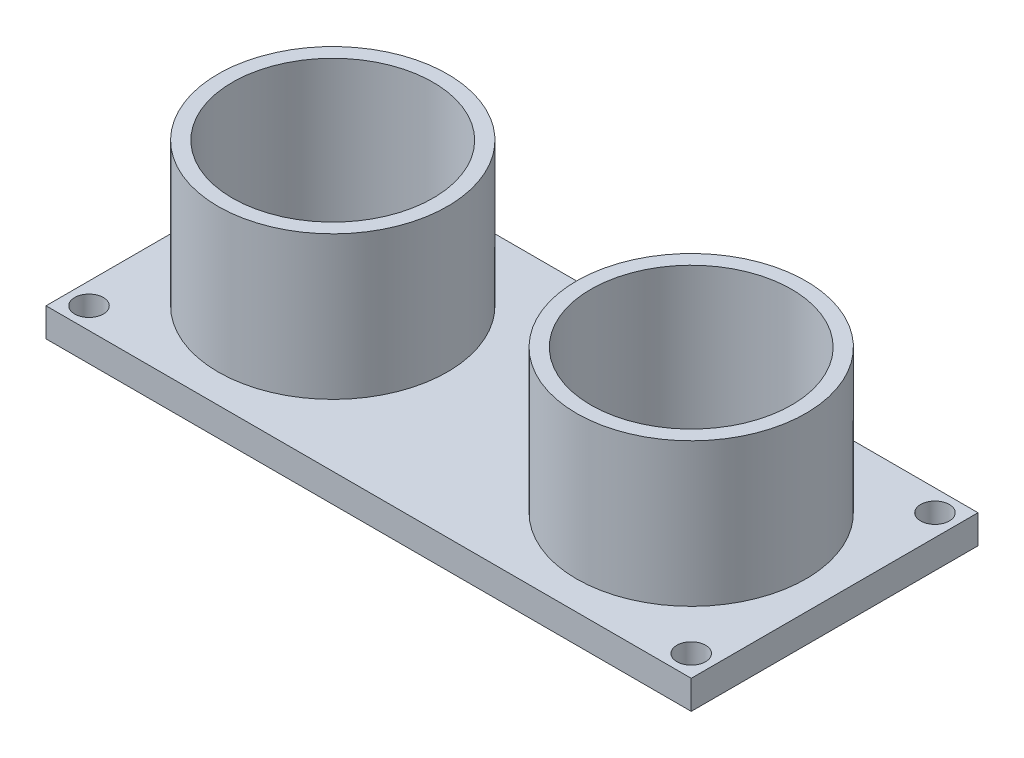
ISO-10303-21;
HEADER;
FILE_DESCRIPTION(('STEP AP214'),'2;1');
FILE_NAME('part.step','',(''),(''),'','','');
FILE_SCHEMA(('AUTOMOTIVE_DESIGN { 1 0 10303 214 1 1 1 1 }'));
ENDSEC;
DATA;
#1=APPLICATION_CONTEXT('core data for automotive mechanical design processes');
#2=APPLICATION_PROTOCOL_DEFINITION('international standard','automotive_design',2000,#1);
#3=PRODUCT_CONTEXT('',#1,'mechanical');
#4=PRODUCT('Part','Part','',(#3));
#5=PRODUCT_RELATED_PRODUCT_CATEGORY('part','',(#4));
#6=PRODUCT_DEFINITION_FORMATION('','',#4);
#7=PRODUCT_DEFINITION_CONTEXT('part definition',#1,'design');
#8=PRODUCT_DEFINITION('design','',#6,#7);
#9=PRODUCT_DEFINITION_SHAPE('','',#8);
#10=(LENGTH_UNIT() NAMED_UNIT(*) SI_UNIT(.MILLI.,.METRE.));
#11=(NAMED_UNIT(*) PLANE_ANGLE_UNIT() SI_UNIT($,.RADIAN.));
#12=(NAMED_UNIT(*) SI_UNIT($,.STERADIAN.) SOLID_ANGLE_UNIT());
#13=UNCERTAINTY_MEASURE_WITH_UNIT(LENGTH_MEASURE(1.E-05),#10,'distance_accuracy_value','');
#14=(GEOMETRIC_REPRESENTATION_CONTEXT(3) GLOBAL_UNCERTAINTY_ASSIGNED_CONTEXT((#13)) GLOBAL_UNIT_ASSIGNED_CONTEXT((#10,
#11,#12)) REPRESENTATION_CONTEXT('',''));
#15=CARTESIAN_POINT('',(0.,0.,0.));
#16=DIRECTION('',(0.,0.,1.));
#17=DIRECTION('',(1.,0.,0.));
#18=AXIS2_PLACEMENT_3D('',#15,#16,#17);
#19=CARTESIAN_POINT('',(0.,2.,10.));
#20=DIRECTION('',(0.,0.,-1.));
#21=DIRECTION('',(-1.,0.,0.));
#22=AXIS2_PLACEMENT_3D('',#19,#20,#21);
#23=PLANE('',#22);
#24=DIRECTION('',(1.,0.,0.));
#25=VECTOR('',#24,1.);
#26=CARTESIAN_POINT('',(0.,0.,10.));
#27=LINE('',#26,#25);
#28=CARTESIAN_POINT('',(-22.5,0.,10.));
#29=VERTEX_POINT('',#28);
#30=CARTESIAN_POINT('',(22.5,0.,10.));
#31=VERTEX_POINT('',#30);
#32=EDGE_CURVE('E121',#29,#31,#27,.T.);
#33=ORIENTED_EDGE('',*,*,#32,.T.);
#34=DIRECTION('',(0.,-1.,0.));
#35=VECTOR('',#34,1.);
#36=CARTESIAN_POINT('',(22.5,2.,10.));
#37=LINE('',#36,#35);
#38=CARTESIAN_POINT('',(22.5,2.,10.));
#39=VERTEX_POINT('',#38);
#40=EDGE_CURVE('E43',#39,#31,#37,.T.);
#41=ORIENTED_EDGE('',*,*,#40,.F.);
#42=DIRECTION('',(1.,0.,0.));
#43=VECTOR('',#42,1.);
#44=CARTESIAN_POINT('',(0.,2.,10.));
#45=LINE('',#44,#43);
#46=CARTESIAN_POINT('',(-22.5,2.,10.));
#47=VERTEX_POINT('',#46);
#48=EDGE_CURVE('E93',#47,#39,#45,.T.);
#49=ORIENTED_EDGE('',*,*,#48,.F.);
#50=DIRECTION('',(0.,-1.,0.));
#51=VECTOR('',#50,1.);
#52=CARTESIAN_POINT('',(-22.5,2.,10.));
#53=LINE('',#52,#51);
#54=EDGE_CURVE('E58',#47,#29,#53,.T.);
#55=ORIENTED_EDGE('',*,*,#54,.T.);
#56=EDGE_LOOP('',(#33,#41,#49,#55));
#57=FACE_BOUND('',#56,.T.);
#58=ADVANCED_FACE('F39',(#57),#23,.F.);
#59=CARTESIAN_POINT('',(22.5,2.,0.));
#60=DIRECTION('',(-1.,0.,0.));
#61=DIRECTION('',(0.,0.,1.));
#62=AXIS2_PLACEMENT_3D('',#59,#60,#61);
#63=PLANE('',#62);
#64=DIRECTION('',(0.,0.,-1.));
#65=VECTOR('',#64,1.);
#66=CARTESIAN_POINT('',(22.5,0.,0.));
#67=LINE('',#66,#65);
#68=CARTESIAN_POINT('',(22.5,0.,-10.));
#69=VERTEX_POINT('',#68);
#70=EDGE_CURVE('E99',#31,#69,#67,.T.);
#71=ORIENTED_EDGE('',*,*,#70,.T.);
#72=DIRECTION('',(0.,-1.,0.));
#73=VECTOR('',#72,1.);
#74=CARTESIAN_POINT('',(22.5,2.,-10.));
#75=LINE('',#74,#73);
#76=CARTESIAN_POINT('',(22.5,2.,-10.));
#77=VERTEX_POINT('',#76);
#78=EDGE_CURVE('E97',#77,#69,#75,.T.);
#79=ORIENTED_EDGE('',*,*,#78,.F.);
#80=DIRECTION('',(0.,0.,-1.));
#81=VECTOR('',#80,1.);
#82=CARTESIAN_POINT('',(22.5,2.,0.));
#83=LINE('',#82,#81);
#84=EDGE_CURVE('E84',#39,#77,#83,.T.);
#85=ORIENTED_EDGE('',*,*,#84,.F.);
#86=ORIENTED_EDGE('',*,*,#40,.T.);
#87=EDGE_LOOP('',(#71,#79,#85,#86));
#88=FACE_BOUND('',#87,.T.);
#89=ADVANCED_FACE('F98',(#88),#63,.F.);
#90=CARTESIAN_POINT('',(0.,2.,-10.));
#91=DIRECTION('',(0.,0.,-1.));
#92=DIRECTION('',(-1.,0.,0.));
#93=AXIS2_PLACEMENT_3D('',#90,#91,#92);
#94=PLANE('',#93);
#95=DIRECTION('',(1.,0.,0.));
#96=VECTOR('',#95,1.);
#97=CARTESIAN_POINT('',(0.,0.,-10.));
#98=LINE('',#97,#96);
#99=CARTESIAN_POINT('',(-22.5,0.,-10.));
#100=VERTEX_POINT('',#99);
#101=EDGE_CURVE('E124',#100,#69,#98,.T.);
#102=ORIENTED_EDGE('',*,*,#101,.F.);
#103=DIRECTION('',(0.,-1.,0.));
#104=VECTOR('',#103,1.);
#105=CARTESIAN_POINT('',(-22.5,2.,-10.));
#106=LINE('',#105,#104);
#107=CARTESIAN_POINT('',(-22.5,2.,-10.));
#108=VERTEX_POINT('',#107);
#109=EDGE_CURVE('E72',#108,#100,#106,.T.);
#110=ORIENTED_EDGE('',*,*,#109,.F.);
#111=DIRECTION('',(1.,0.,0.));
#112=VECTOR('',#111,1.);
#113=CARTESIAN_POINT('',(0.,2.,-10.));
#114=LINE('',#113,#112);
#115=EDGE_CURVE('E92',#108,#77,#114,.T.);
#116=ORIENTED_EDGE('',*,*,#115,.T.);
#117=ORIENTED_EDGE('',*,*,#78,.T.);
#118=EDGE_LOOP('',(#102,#110,#116,#117));
#119=FACE_BOUND('',#118,.T.);
#120=ADVANCED_FACE('F102',(#119),#94,.T.);
#121=CARTESIAN_POINT('',(21.,2.,8.49999999999985));
#122=DIRECTION('',(0.,-1.,0.));
#123=DIRECTION('',(0.,0.,-1.));
#124=AXIS2_PLACEMENT_3D('',#121,#122,#123);
#125=CYLINDRICAL_SURFACE('',#124,1.);
#126=CARTESIAN_POINT('',(21.,2.,8.49999999999985));
#127=DIRECTION('',(0.,1.,0.));
#128=DIRECTION('',(0.,0.,1.));
#129=AXIS2_PLACEMENT_3D('',#126,#127,#128);
#130=CIRCLE('',#129,1.);
#131=CARTESIAN_POINT('',(21.,2.,9.49999999999986));
#132=VERTEX_POINT('',#131);
#133=EDGE_CURVE('E105',#132,#132,#130,.T.);
#134=ORIENTED_EDGE('',*,*,#133,.T.);
#135=EDGE_LOOP('',(#134));
#136=FACE_BOUND('',#135,.T.);
#137=CARTESIAN_POINT('',(21.,0.,8.49999999999985));
#138=DIRECTION('',(0.,1.,0.));
#139=DIRECTION('',(0.,0.,1.));
#140=AXIS2_PLACEMENT_3D('',#137,#138,#139);
#141=CIRCLE('',#140,1.);
#142=CARTESIAN_POINT('',(21.,0.,9.49999999999986));
#143=VERTEX_POINT('',#142);
#144=EDGE_CURVE('E129',#143,#143,#141,.T.);
#145=ORIENTED_EDGE('',*,*,#144,.F.);
#146=EDGE_LOOP('',(#145));
#147=FACE_BOUND('',#146,.T.);
#148=ADVANCED_FACE('F204',(#136,#147),#125,.F.);
#149=CARTESIAN_POINT('',(-22.5,2.,0.));
#150=DIRECTION('',(-1.,0.,0.));
#151=DIRECTION('',(0.,0.,1.));
#152=AXIS2_PLACEMENT_3D('',#149,#150,#151);
#153=PLANE('',#152);
#154=DIRECTION('',(0.,0.,-1.));
#155=VECTOR('',#154,1.);
#156=CARTESIAN_POINT('',(-22.5,0.,0.));
#157=LINE('',#156,#155);
#158=EDGE_CURVE('E126',#29,#100,#157,.T.);
#159=ORIENTED_EDGE('',*,*,#158,.F.);
#160=ORIENTED_EDGE('',*,*,#54,.F.);
#161=DIRECTION('',(0.,0.,-1.));
#162=VECTOR('',#161,1.);
#163=CARTESIAN_POINT('',(-22.5,2.,0.));
#164=LINE('',#163,#162);
#165=EDGE_CURVE('E103',#47,#108,#164,.T.);
#166=ORIENTED_EDGE('',*,*,#165,.T.);
#167=ORIENTED_EDGE('',*,*,#109,.T.);
#168=EDGE_LOOP('',(#159,#160,#166,#167));
#169=FACE_BOUND('',#168,.T.);
#170=ADVANCED_FACE('F196',(#169),#153,.T.);
#171=CARTESIAN_POINT('',(-21.,2.,-8.5));
#172=DIRECTION('',(0.,-1.,0.));
#173=DIRECTION('',(0.,0.,-1.));
#174=AXIS2_PLACEMENT_3D('',#171,#172,#173);
#175=CYLINDRICAL_SURFACE('',#174,1.);
#176=CARTESIAN_POINT('',(-21.,2.,-8.5));
#177=DIRECTION('',(0.,1.,0.));
#178=DIRECTION('',(0.,0.,1.));
#179=AXIS2_PLACEMENT_3D('',#176,#177,#178);
#180=CIRCLE('',#179,1.);
#181=CARTESIAN_POINT('',(-21.,2.,-7.5));
#182=VERTEX_POINT('',#181);
#183=EDGE_CURVE('E140',#182,#182,#180,.T.);
#184=ORIENTED_EDGE('',*,*,#183,.T.);
#185=EDGE_LOOP('',(#184));
#186=FACE_BOUND('',#185,.T.);
#187=CARTESIAN_POINT('',(-21.,0.,-8.5));
#188=DIRECTION('',(0.,1.,0.));
#189=DIRECTION('',(0.,0.,1.));
#190=AXIS2_PLACEMENT_3D('',#187,#188,#189);
#191=CIRCLE('',#190,1.);
#192=CARTESIAN_POINT('',(-21.,0.,-7.5));
#193=VERTEX_POINT('',#192);
#194=EDGE_CURVE('E117',#193,#193,#191,.T.);
#195=ORIENTED_EDGE('',*,*,#194,.F.);
#196=EDGE_LOOP('',(#195));
#197=FACE_BOUND('',#196,.T.);
#198=ADVANCED_FACE('F194',(#186,#197),#175,.F.);
#199=CARTESIAN_POINT('',(-21.,2.,8.5));
#200=DIRECTION('',(0.,-1.,0.));
#201=DIRECTION('',(0.,0.,-1.));
#202=AXIS2_PLACEMENT_3D('',#199,#200,#201);
#203=CYLINDRICAL_SURFACE('',#202,1.);
#204=CARTESIAN_POINT('',(-21.,2.,8.5));
#205=DIRECTION('',(0.,1.,0.));
#206=DIRECTION('',(0.,0.,1.));
#207=AXIS2_PLACEMENT_3D('',#204,#205,#206);
#208=CIRCLE('',#207,1.);
#209=CARTESIAN_POINT('',(-21.,2.,9.5));
#210=VERTEX_POINT('',#209);
#211=EDGE_CURVE('E135',#210,#210,#208,.F.);
#212=ORIENTED_EDGE('',*,*,#211,.F.);
#213=EDGE_LOOP('',(#212));
#214=FACE_BOUND('',#213,.T.);
#215=CARTESIAN_POINT('',(-21.,0.,8.5));
#216=DIRECTION('',(0.,1.,0.));
#217=DIRECTION('',(0.,0.,1.));
#218=AXIS2_PLACEMENT_3D('',#215,#216,#217);
#219=CIRCLE('',#218,1.);
#220=CARTESIAN_POINT('',(-21.,0.,9.5));
#221=VERTEX_POINT('',#220);
#222=EDGE_CURVE('E114',#221,#221,#219,.F.);
#223=ORIENTED_EDGE('',*,*,#222,.T.);
#224=EDGE_LOOP('',(#223));
#225=FACE_BOUND('',#224,.T.);
#226=ADVANCED_FACE('F41',(#214,#225),#203,.F.);
#227=CARTESIAN_POINT('',(20.9999999999999,2.,-8.50000000000015));
#228=DIRECTION('',(0.,-1.,0.));
#229=DIRECTION('',(0.,0.,-1.));
#230=AXIS2_PLACEMENT_3D('',#227,#228,#229);
#231=CYLINDRICAL_SURFACE('',#230,1.);
#232=CARTESIAN_POINT('',(20.9999999999999,2.,-8.50000000000015));
#233=DIRECTION('',(0.,1.,0.));
#234=DIRECTION('',(0.,0.,1.));
#235=AXIS2_PLACEMENT_3D('',#232,#233,#234);
#236=CIRCLE('',#235,1.);
#237=CARTESIAN_POINT('',(20.9999999999999,2.,-7.50000000000015));
#238=VERTEX_POINT('',#237);
#239=EDGE_CURVE('E111',#238,#238,#236,.F.);
#240=ORIENTED_EDGE('',*,*,#239,.F.);
#241=EDGE_LOOP('',(#240));
#242=FACE_BOUND('',#241,.T.);
#243=CARTESIAN_POINT('',(20.9999999999999,0.,-8.50000000000015));
#244=DIRECTION('',(0.,1.,0.));
#245=DIRECTION('',(0.,0.,1.));
#246=AXIS2_PLACEMENT_3D('',#243,#244,#245);
#247=CIRCLE('',#246,1.);
#248=CARTESIAN_POINT('',(20.9999999999999,0.,-7.50000000000015));
#249=VERTEX_POINT('',#248);
#250=EDGE_CURVE('E132',#249,#249,#247,.F.);
#251=ORIENTED_EDGE('',*,*,#250,.T.);
#252=EDGE_LOOP('',(#251));
#253=FACE_BOUND('',#252,.T.);
#254=ADVANCED_FACE('F202',(#242,#253),#231,.F.);
#255=CARTESIAN_POINT('',(0.,2.,0.));
#256=DIRECTION('',(0.,1.,0.));
#257=DIRECTION('',(0.,0.,1.));
#258=AXIS2_PLACEMENT_3D('',#255,#256,#257);
#259=PLANE('',#258);
#260=CARTESIAN_POINT('',(12.5,2.,0.));
#261=DIRECTION('',(0.,1.,0.));
#262=DIRECTION('',(0.,0.,1.));
#263=AXIS2_PLACEMENT_3D('',#260,#261,#262);
#264=CIRCLE('',#263,8.);
#265=CARTESIAN_POINT('',(12.5,2.,7.99999999999992));
#266=VERTEX_POINT('',#265);
#267=EDGE_CURVE('E156',#266,#266,#264,.F.);
#268=ORIENTED_EDGE('',*,*,#267,.T.);
#269=EDGE_LOOP('',(#268));
#270=FACE_BOUND('',#269,.T.);
#271=CARTESIAN_POINT('',(-12.5,2.,0.));
#272=DIRECTION('',(0.,1.,0.));
#273=DIRECTION('',(0.,0.,1.));
#274=AXIS2_PLACEMENT_3D('',#271,#272,#273);
#275=CIRCLE('',#274,8.);
#276=CARTESIAN_POINT('',(-12.5,2.,8.));
#277=VERTEX_POINT('',#276);
#278=EDGE_CURVE('E118',#277,#277,#275,.F.);
#279=ORIENTED_EDGE('',*,*,#278,.T.);
#280=EDGE_LOOP('',(#279));
#281=FACE_BOUND('',#280,.T.);
#282=ORIENTED_EDGE('',*,*,#211,.T.);
#283=EDGE_LOOP('',(#282));
#284=FACE_BOUND('',#283,.T.);
#285=ORIENTED_EDGE('',*,*,#183,.F.);
#286=EDGE_LOOP('',(#285));
#287=FACE_BOUND('',#286,.T.);
#288=ORIENTED_EDGE('',*,*,#48,.T.);
#289=ORIENTED_EDGE('',*,*,#84,.T.);
#290=ORIENTED_EDGE('',*,*,#115,.F.);
#291=ORIENTED_EDGE('',*,*,#165,.F.);
#292=EDGE_LOOP('',(#288,#289,#290,#291));
#293=FACE_BOUND('',#292,.T.);
#294=ORIENTED_EDGE('',*,*,#133,.F.);
#295=EDGE_LOOP('',(#294));
#296=FACE_BOUND('',#295,.T.);
#297=ORIENTED_EDGE('',*,*,#239,.T.);
#298=EDGE_LOOP('',(#297));
#299=FACE_BOUND('',#298,.T.);
#300=ADVANCED_FACE('F88',(#270,#281,#284,#287,#293,#296,#299),#259,.T.);
#301=CARTESIAN_POINT('',(0.,0.,0.));
#302=DIRECTION('',(0.,1.,0.));
#303=DIRECTION('',(0.,0.,1.));
#304=AXIS2_PLACEMENT_3D('',#301,#302,#303);
#305=PLANE('',#304);
#306=ORIENTED_EDGE('',*,*,#222,.F.);
#307=EDGE_LOOP('',(#306));
#308=FACE_BOUND('',#307,.T.);
#309=ORIENTED_EDGE('',*,*,#194,.T.);
#310=EDGE_LOOP('',(#309));
#311=FACE_BOUND('',#310,.T.);
#312=ORIENTED_EDGE('',*,*,#32,.F.);
#313=ORIENTED_EDGE('',*,*,#158,.T.);
#314=ORIENTED_EDGE('',*,*,#101,.T.);
#315=ORIENTED_EDGE('',*,*,#70,.F.);
#316=EDGE_LOOP('',(#312,#313,#314,#315));
#317=FACE_BOUND('',#316,.T.);
#318=ORIENTED_EDGE('',*,*,#144,.T.);
#319=EDGE_LOOP('',(#318));
#320=FACE_BOUND('',#319,.T.);
#321=ORIENTED_EDGE('',*,*,#250,.F.);
#322=EDGE_LOOP('',(#321));
#323=FACE_BOUND('',#322,.T.);
#324=ADVANCED_FACE('F210',(#308,#311,#317,#320,#323),#305,.F.);
#325=CARTESIAN_POINT('',(-12.5,12.,0.));
#326=DIRECTION('',(0.,-1.,0.));
#327=DIRECTION('',(0.,0.,-1.));
#328=AXIS2_PLACEMENT_3D('',#325,#326,#327);
#329=CYLINDRICAL_SURFACE('',#328,7.);
#330=CARTESIAN_POINT('',(-12.5,2.,0.));
#331=DIRECTION('',(0.,1.,0.));
#332=DIRECTION('',(0.,0.,1.));
#333=AXIS2_PLACEMENT_3D('',#330,#331,#332);
#334=CIRCLE('',#333,7.);
#335=CARTESIAN_POINT('',(-12.5,2.,7.));
#336=VERTEX_POINT('',#335);
#337=EDGE_CURVE('E49',#336,#336,#334,.F.);
#338=ORIENTED_EDGE('',*,*,#337,.T.);
#339=EDGE_LOOP('',(#338));
#340=FACE_BOUND('',#339,.T.);
#341=CARTESIAN_POINT('',(-12.5,12.,0.));
#342=DIRECTION('',(0.,1.,0.));
#343=DIRECTION('',(0.,0.,1.));
#344=AXIS2_PLACEMENT_3D('',#341,#342,#343);
#345=CIRCLE('',#344,7.);
#346=CARTESIAN_POINT('',(-12.5,12.,7.));
#347=VERTEX_POINT('',#346);
#348=EDGE_CURVE('E154',#347,#347,#345,.T.);
#349=ORIENTED_EDGE('',*,*,#348,.T.);
#350=EDGE_LOOP('',(#349));
#351=FACE_BOUND('',#350,.T.);
#352=ADVANCED_FACE('F213',(#340,#351),#329,.F.);
#353=CARTESIAN_POINT('',(-12.5,12.,0.));
#354=DIRECTION('',(0.,-1.,0.));
#355=DIRECTION('',(0.,0.,-1.));
#356=AXIS2_PLACEMENT_3D('',#353,#354,#355);
#357=CYLINDRICAL_SURFACE('',#356,8.);
#358=ORIENTED_EDGE('',*,*,#278,.F.);
#359=EDGE_LOOP('',(#358));
#360=FACE_BOUND('',#359,.T.);
#361=CARTESIAN_POINT('',(-12.5,12.,0.));
#362=DIRECTION('',(0.,1.,0.));
#363=DIRECTION('',(0.,0.,1.));
#364=AXIS2_PLACEMENT_3D('',#361,#362,#363);
#365=CIRCLE('',#364,8.);
#366=CARTESIAN_POINT('',(-12.5,12.,8.));
#367=VERTEX_POINT('',#366);
#368=EDGE_CURVE('E151',#367,#367,#365,.T.);
#369=ORIENTED_EDGE('',*,*,#368,.F.);
#370=EDGE_LOOP('',(#369));
#371=FACE_BOUND('',#370,.T.);
#372=ADVANCED_FACE('F235',(#360,#371),#357,.T.);
#373=CARTESIAN_POINT('',(0.,12.,0.));
#374=DIRECTION('',(0.,1.,0.));
#375=DIRECTION('',(0.,0.,1.));
#376=AXIS2_PLACEMENT_3D('',#373,#374,#375);
#377=PLANE('',#376);
#378=ORIENTED_EDGE('',*,*,#348,.F.);
#379=EDGE_LOOP('',(#378));
#380=FACE_BOUND('',#379,.T.);
#381=ORIENTED_EDGE('',*,*,#368,.T.);
#382=EDGE_LOOP('',(#381));
#383=FACE_BOUND('',#382,.T.);
#384=ADVANCED_FACE('F239',(#380,#383),#377,.T.);
#385=ORIENTED_EDGE('',*,*,#337,.F.);
#386=EDGE_LOOP('',(#385));
#387=FACE_BOUND('',#386,.T.);
#388=ADVANCED_FACE('F183',(#387),#259,.T.);
#389=CARTESIAN_POINT('',(12.5,12.,0.));
#390=DIRECTION('',(0.,-1.,0.));
#391=DIRECTION('',(0.,0.,-1.));
#392=AXIS2_PLACEMENT_3D('',#389,#390,#391);
#393=CYLINDRICAL_SURFACE('',#392,7.);
#394=CARTESIAN_POINT('',(12.5,2.,0.));
#395=DIRECTION('',(0.,1.,0.));
#396=DIRECTION('',(0.,0.,1.));
#397=AXIS2_PLACEMENT_3D('',#394,#395,#396);
#398=CIRCLE('',#397,7.);
#399=CARTESIAN_POINT('',(12.5,2.,6.99999999999991));
#400=VERTEX_POINT('',#399);
#401=EDGE_CURVE('E11',#400,#400,#398,.F.);
#402=ORIENTED_EDGE('',*,*,#401,.T.);
#403=EDGE_LOOP('',(#402));
#404=FACE_BOUND('',#403,.T.);
#405=CARTESIAN_POINT('',(12.5,12.,0.));
#406=DIRECTION('',(0.,1.,0.));
#407=DIRECTION('',(0.,0.,1.));
#408=AXIS2_PLACEMENT_3D('',#405,#406,#407);
#409=CIRCLE('',#408,7.);
#410=CARTESIAN_POINT('',(12.5,12.,6.99999999999991));
#411=VERTEX_POINT('',#410);
#412=EDGE_CURVE('E163',#411,#411,#409,.T.);
#413=ORIENTED_EDGE('',*,*,#412,.T.);
#414=EDGE_LOOP('',(#413));
#415=FACE_BOUND('',#414,.T.);
#416=ADVANCED_FACE('F167',(#404,#415),#393,.F.);
#417=CARTESIAN_POINT('',(12.5,12.,0.));
#418=DIRECTION('',(0.,-1.,0.));
#419=DIRECTION('',(0.,0.,-1.));
#420=AXIS2_PLACEMENT_3D('',#417,#418,#419);
#421=CYLINDRICAL_SURFACE('',#420,8.);
#422=ORIENTED_EDGE('',*,*,#267,.F.);
#423=EDGE_LOOP('',(#422));
#424=FACE_BOUND('',#423,.T.);
#425=CARTESIAN_POINT('',(12.5,12.,0.));
#426=DIRECTION('',(0.,1.,0.));
#427=DIRECTION('',(0.,0.,1.));
#428=AXIS2_PLACEMENT_3D('',#425,#426,#427);
#429=CIRCLE('',#428,8.);
#430=CARTESIAN_POINT('',(12.5,12.,7.99999999999992));
#431=VERTEX_POINT('',#430);
#432=EDGE_CURVE('E160',#431,#431,#429,.T.);
#433=ORIENTED_EDGE('',*,*,#432,.F.);
#434=EDGE_LOOP('',(#433));
#435=FACE_BOUND('',#434,.T.);
#436=ADVANCED_FACE('F173',(#424,#435),#421,.T.);
#437=CARTESIAN_POINT('',(0.,12.,0.));
#438=DIRECTION('',(0.,1.,0.));
#439=DIRECTION('',(0.,0.,1.));
#440=AXIS2_PLACEMENT_3D('',#437,#438,#439);
#441=PLANE('',#440);
#442=ORIENTED_EDGE('',*,*,#412,.F.);
#443=EDGE_LOOP('',(#442));
#444=FACE_BOUND('',#443,.T.);
#445=ORIENTED_EDGE('',*,*,#432,.T.);
#446=EDGE_LOOP('',(#445));
#447=FACE_BOUND('',#446,.T.);
#448=ADVANCED_FACE('F169',(#444,#447),#441,.T.);
#449=ORIENTED_EDGE('',*,*,#401,.F.);
#450=EDGE_LOOP('',(#449));
#451=FACE_BOUND('',#450,.T.);
#452=ADVANCED_FACE('F172',(#451),#259,.T.);
#453=CLOSED_SHELL('',(#58,#89,#120,#148,#170,#198,#226,#254,#300,#324,#352,#372,#384,#388,#416,
#436,#448,#452));
#454=MANIFOLD_SOLID_BREP('B2',#453);
#455=ADVANCED_BREP_SHAPE_REPRESENTATION('',(#18,#454),#14);
#456=SHAPE_DEFINITION_REPRESENTATION(#9,#455);
ENDSEC;
END-ISO-10303-21;
